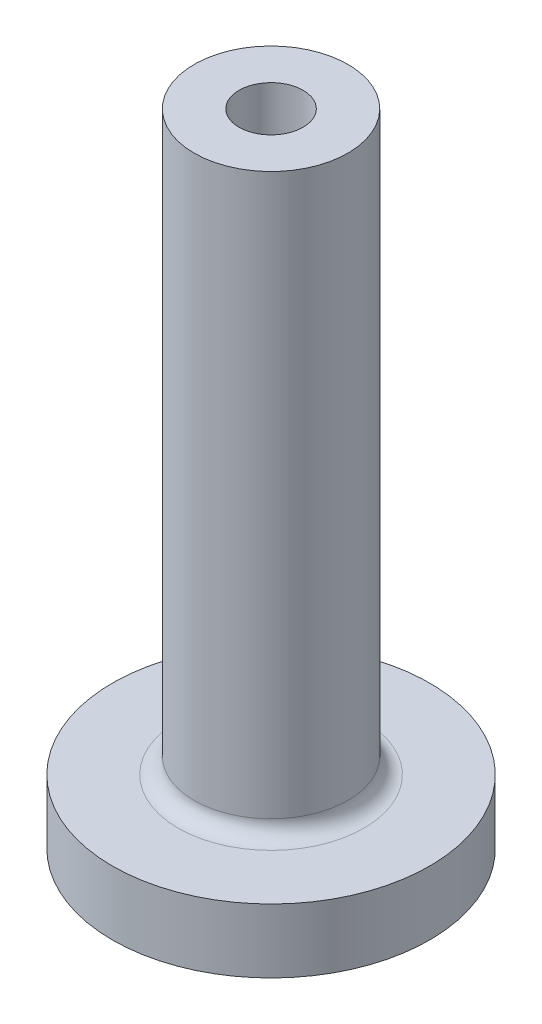
ISO-10303-21;
HEADER;
FILE_DESCRIPTION(('STEP AP214'),'2;1');
FILE_NAME('part.step','',(''),(''),'','','');
FILE_SCHEMA(('AUTOMOTIVE_DESIGN { 1 0 10303 214 1 1 1 1 }'));
ENDSEC;
DATA;
#1=APPLICATION_CONTEXT('core data for automotive mechanical design processes');
#2=APPLICATION_PROTOCOL_DEFINITION('international standard','automotive_design',2000,#1);
#3=PRODUCT_CONTEXT('',#1,'mechanical');
#4=PRODUCT('Part','Part','',(#3));
#5=PRODUCT_RELATED_PRODUCT_CATEGORY('part','',(#4));
#6=PRODUCT_DEFINITION_FORMATION('','',#4);
#7=PRODUCT_DEFINITION_CONTEXT('part definition',#1,'design');
#8=PRODUCT_DEFINITION('design','',#6,#7);
#9=PRODUCT_DEFINITION_SHAPE('','',#8);
#10=(LENGTH_UNIT() NAMED_UNIT(*) SI_UNIT(.MILLI.,.METRE.));
#11=(NAMED_UNIT(*) PLANE_ANGLE_UNIT() SI_UNIT($,.RADIAN.));
#12=(NAMED_UNIT(*) SI_UNIT($,.STERADIAN.) SOLID_ANGLE_UNIT());
#13=UNCERTAINTY_MEASURE_WITH_UNIT(LENGTH_MEASURE(1.E-05),#10,'distance_accuracy_value','');
#14=(GEOMETRIC_REPRESENTATION_CONTEXT(3) GLOBAL_UNCERTAINTY_ASSIGNED_CONTEXT((#13)) GLOBAL_UNIT_ASSIGNED_CONTEXT((#10,
#11,#12)) REPRESENTATION_CONTEXT('',''));
#15=CARTESIAN_POINT('',(0.,0.,0.));
#16=DIRECTION('',(0.,0.,1.));
#17=DIRECTION('',(1.,0.,0.));
#18=AXIS2_PLACEMENT_3D('',#15,#16,#17);
#19=CARTESIAN_POINT('',(0.,4.,0.));
#20=DIRECTION('',(0.,-1.,0.));
#21=DIRECTION('',(0.,0.,-1.));
#22=AXIS2_PLACEMENT_3D('',#19,#20,#21);
#23=CYLINDRICAL_SURFACE('',#22,9.9);
#24=CARTESIAN_POINT('',(0.,4.,0.));
#25=DIRECTION('',(0.,1.,0.));
#26=DIRECTION('',(0.,0.,1.));
#27=AXIS2_PLACEMENT_3D('',#24,#25,#26);
#28=CIRCLE('',#27,9.9);
#29=CARTESIAN_POINT('',(0.,4.,9.9));
#30=VERTEX_POINT('',#29);
#31=EDGE_CURVE('E50',#30,#30,#28,.T.);
#32=ORIENTED_EDGE('',*,*,#31,.F.);
#33=EDGE_LOOP('',(#32));
#34=FACE_BOUND('',#33,.T.);
#35=CARTESIAN_POINT('',(0.,0.,0.));
#36=DIRECTION('',(0.,1.,0.));
#37=DIRECTION('',(0.,0.,1.));
#38=AXIS2_PLACEMENT_3D('',#35,#36,#37);
#39=CIRCLE('',#38,9.9);
#40=CARTESIAN_POINT('',(0.,0.,9.9));
#41=VERTEX_POINT('',#40);
#42=EDGE_CURVE('E54',#41,#41,#39,.T.);
#43=ORIENTED_EDGE('',*,*,#42,.T.);
#44=EDGE_LOOP('',(#43));
#45=FACE_BOUND('',#44,.T.);
#46=ADVANCED_FACE('F39',(#34,#45),#23,.T.);
#47=CARTESIAN_POINT('',(0.,4.,0.));
#48=DIRECTION('',(0.,1.,0.));
#49=DIRECTION('',(0.,0.,1.));
#50=AXIS2_PLACEMENT_3D('',#47,#48,#49);
#51=PLANE('',#50);
#52=CARTESIAN_POINT('',(0.,4.,0.));
#53=DIRECTION('',(0.,1.,0.));
#54=DIRECTION('',(0.,0.,1.));
#55=AXIS2_PLACEMENT_3D('',#52,#53,#54);
#56=CIRCLE('',#55,5.8);
#57=CARTESIAN_POINT('',(0.,4.,5.8));
#58=VERTEX_POINT('',#57);
#59=EDGE_CURVE('E10',#58,#58,#56,.F.);
#60=ORIENTED_EDGE('',*,*,#59,.T.);
#61=EDGE_LOOP('',(#60));
#62=FACE_BOUND('',#61,.T.);
#63=ORIENTED_EDGE('',*,*,#31,.T.);
#64=EDGE_LOOP('',(#63));
#65=FACE_BOUND('',#64,.T.);
#66=ADVANCED_FACE('F92',(#62,#65),#51,.T.);
#67=CARTESIAN_POINT('',(0.,0.,0.));
#68=DIRECTION('',(0.,1.,0.));
#69=DIRECTION('',(0.,0.,1.));
#70=AXIS2_PLACEMENT_3D('',#67,#68,#69);
#71=PLANE('',#70);
#72=ORIENTED_EDGE('',*,*,#42,.F.);
#73=EDGE_LOOP('',(#72));
#74=FACE_BOUND('',#73,.T.);
#75=ADVANCED_FACE('F85',(#74),#71,.F.);
#76=CARTESIAN_POINT('',(0.,40.,0.));
#77=DIRECTION('',(0.,-1.,0.));
#78=DIRECTION('',(0.,0.,-1.));
#79=AXIS2_PLACEMENT_3D('',#76,#77,#78);
#80=CYLINDRICAL_SURFACE('',#79,4.8);
#81=CARTESIAN_POINT('',(0.,5.,0.));
#82=DIRECTION('',(0.,1.,0.));
#83=DIRECTION('',(0.,0.,1.));
#84=AXIS2_PLACEMENT_3D('',#81,#82,#83);
#85=CIRCLE('',#84,4.8);
#86=CARTESIAN_POINT('',(0.,5.,4.8));
#87=VERTEX_POINT('',#86);
#88=EDGE_CURVE('E46',#87,#87,#85,.T.);
#89=ORIENTED_EDGE('',*,*,#88,.T.);
#90=EDGE_LOOP('',(#89));
#91=FACE_BOUND('',#90,.T.);
#92=CARTESIAN_POINT('',(0.,40.,0.));
#93=DIRECTION('',(0.,1.,0.));
#94=DIRECTION('',(0.,0.,1.));
#95=AXIS2_PLACEMENT_3D('',#92,#93,#94);
#96=CIRCLE('',#95,4.8);
#97=CARTESIAN_POINT('',(0.,40.,4.8));
#98=VERTEX_POINT('',#97);
#99=EDGE_CURVE('E58',#98,#98,#96,.T.);
#100=ORIENTED_EDGE('',*,*,#99,.F.);
#101=EDGE_LOOP('',(#100));
#102=FACE_BOUND('',#101,.T.);
#103=ADVANCED_FACE('F80',(#91,#102),#80,.T.);
#104=CARTESIAN_POINT('',(0.,40.,0.));
#105=DIRECTION('',(0.,1.,0.));
#106=DIRECTION('',(0.,0.,1.));
#107=AXIS2_PLACEMENT_3D('',#104,#105,#106);
#108=PLANE('',#107);
#109=CARTESIAN_POINT('',(0.,40.,0.));
#110=DIRECTION('',(0.,1.,0.));
#111=DIRECTION('',(0.,0.,1.));
#112=AXIS2_PLACEMENT_3D('',#109,#110,#111);
#113=CIRCLE('',#112,2.);
#114=CARTESIAN_POINT('',(0.,40.,2.));
#115=VERTEX_POINT('',#114);
#116=EDGE_CURVE('E63',#115,#115,#113,.T.);
#117=ORIENTED_EDGE('',*,*,#116,.F.);
#118=EDGE_LOOP('',(#117));
#119=FACE_BOUND('',#118,.T.);
#120=ORIENTED_EDGE('',*,*,#99,.T.);
#121=EDGE_LOOP('',(#120));
#122=FACE_BOUND('',#121,.T.);
#123=ADVANCED_FACE('F74',(#119,#122),#108,.T.);
#124=CARTESIAN_POINT('',(0.,32.,0.));
#125=DIRECTION('',(0.,1.,0.));
#126=DIRECTION('',(0.,0.,1.));
#127=AXIS2_PLACEMENT_3D('',#124,#125,#126);
#128=CYLINDRICAL_SURFACE('',#127,2.);
#129=CARTESIAN_POINT('',(0.,32.,0.));
#130=DIRECTION('',(0.,1.,0.));
#131=DIRECTION('',(0.,0.,1.));
#132=AXIS2_PLACEMENT_3D('',#129,#130,#131);
#133=CIRCLE('',#132,2.);
#134=CARTESIAN_POINT('',(0.,32.,2.));
#135=VERTEX_POINT('',#134);
#136=EDGE_CURVE('E62',#135,#135,#133,.T.);
#137=ORIENTED_EDGE('',*,*,#136,.F.);
#138=EDGE_LOOP('',(#137));
#139=FACE_BOUND('',#138,.T.);
#140=ORIENTED_EDGE('',*,*,#116,.T.);
#141=EDGE_LOOP('',(#140));
#142=FACE_BOUND('',#141,.T.);
#143=ADVANCED_FACE('F71',(#139,#142),#128,.F.);
#144=CARTESIAN_POINT('',(0.,32.,0.));
#145=DIRECTION('',(0.,1.,0.));
#146=DIRECTION('',(0.,0.,1.));
#147=AXIS2_PLACEMENT_3D('',#144,#145,#146);
#148=PLANE('',#147);
#149=ORIENTED_EDGE('',*,*,#136,.T.);
#150=EDGE_LOOP('',(#149));
#151=FACE_BOUND('',#150,.T.);
#152=ADVANCED_FACE('F69',(#151),#148,.T.);
#153=CARTESIAN_POINT('',(0.,5.,0.));
#154=DIRECTION('',(0.,1.,0.));
#155=DIRECTION('',(0.,0.,1.));
#156=AXIS2_PLACEMENT_3D('',#153,#154,#155);
#157=TOROIDAL_SURFACE('',#156,5.8,1.);
#158=ORIENTED_EDGE('',*,*,#59,.F.);
#159=EDGE_LOOP('',(#158));
#160=FACE_BOUND('',#159,.T.);
#161=ORIENTED_EDGE('',*,*,#88,.F.);
#162=EDGE_LOOP('',(#161));
#163=FACE_BOUND('',#162,.T.);
#164=ADVANCED_FACE('F41',(#160,#163),#157,.F.);
#165=CLOSED_SHELL('',(#46,#66,#75,#103,#123,#143,#152,#164));
#166=MANIFOLD_SOLID_BREP('B2',#165);
#167=ADVANCED_BREP_SHAPE_REPRESENTATION('',(#18,#166),#14);
#168=SHAPE_DEFINITION_REPRESENTATION(#9,#167);
ENDSEC;
END-ISO-10303-21;
